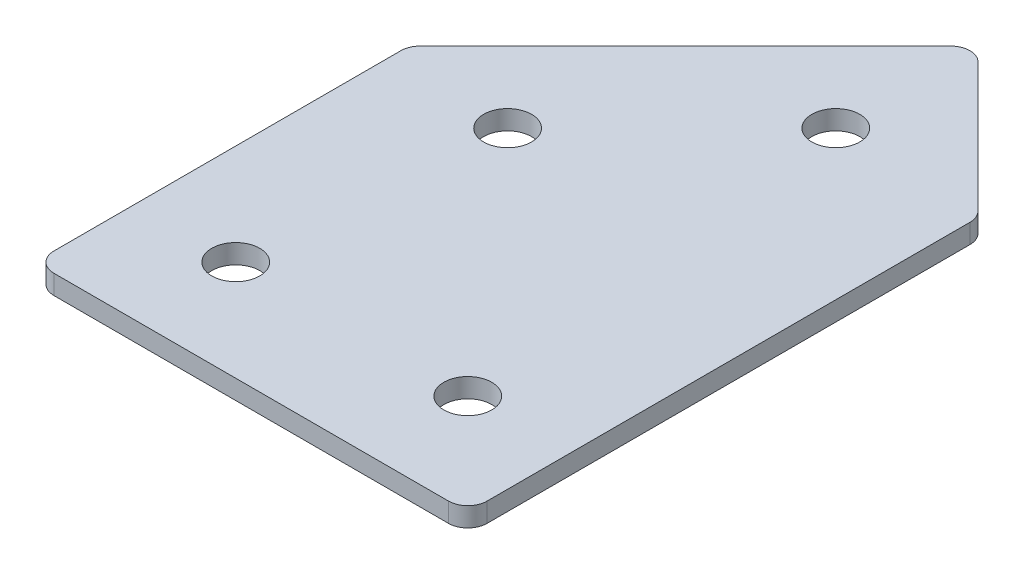
ISO-10303-21;
HEADER;
FILE_DESCRIPTION(('STEP AP214'),'2;1');
FILE_NAME('part.step','',(''),(''),'','','');
FILE_SCHEMA(('AUTOMOTIVE_DESIGN { 1 0 10303 214 1 1 1 1 }'));
ENDSEC;
DATA;
#1=APPLICATION_CONTEXT('core data for automotive mechanical design processes');
#2=APPLICATION_PROTOCOL_DEFINITION('international standard','automotive_design',2000,#1);
#3=PRODUCT_CONTEXT('',#1,'mechanical');
#4=PRODUCT('Part','Part','',(#3));
#5=PRODUCT_RELATED_PRODUCT_CATEGORY('part','',(#4));
#6=PRODUCT_DEFINITION_FORMATION('','',#4);
#7=PRODUCT_DEFINITION_CONTEXT('part definition',#1,'design');
#8=PRODUCT_DEFINITION('design','',#6,#7);
#9=PRODUCT_DEFINITION_SHAPE('','',#8);
#10=(LENGTH_UNIT() NAMED_UNIT(*) SI_UNIT(.MILLI.,.METRE.));
#11=(NAMED_UNIT(*) PLANE_ANGLE_UNIT() SI_UNIT($,.RADIAN.));
#12=(NAMED_UNIT(*) SI_UNIT($,.STERADIAN.) SOLID_ANGLE_UNIT());
#13=UNCERTAINTY_MEASURE_WITH_UNIT(LENGTH_MEASURE(1.E-05),#10,'distance_accuracy_value','');
#14=(GEOMETRIC_REPRESENTATION_CONTEXT(3) GLOBAL_UNCERTAINTY_ASSIGNED_CONTEXT((#13)) GLOBAL_UNIT_ASSIGNED_CONTEXT((#10,
#11,#12)) REPRESENTATION_CONTEXT('',''));
#15=CARTESIAN_POINT('',(0.,0.,0.));
#16=DIRECTION('',(0.,0.,1.));
#17=DIRECTION('',(1.,0.,0.));
#18=AXIS2_PLACEMENT_3D('',#15,#16,#17);
#19=CARTESIAN_POINT('',(-13.6552380952464,-1.25,26.3480194846605));
#20=DIRECTION('',(0.,1.,0.));
#21=DIRECTION('',(0.,0.,1.));
#22=AXIS2_PLACEMENT_3D('',#19,#20,#21);
#23=PLANE('',#22);
#24=CARTESIAN_POINT('',(46.3447619047619,-1.25,26.3480194846605));
#25=DIRECTION('',(0.,1.,0.));
#26=DIRECTION('',(0.,0.,1.));
#27=AXIS2_PLACEMENT_3D('',#24,#25,#26);
#28=CIRCLE('',#27,3.1);
#29=CARTESIAN_POINT('',(46.3447619047619,-1.25,29.4480194846605));
#30=VERTEX_POINT('',#29);
#31=EDGE_CURVE('E201',#30,#30,#28,.T.);
#32=ORIENTED_EDGE('',*,*,#31,.T.);
#33=EDGE_LOOP('',(#32));
#34=FACE_BOUND('',#33,.T.);
#35=CARTESIAN_POINT('',(40.1315584691654,-1.25,-27.438777079743));
#36=DIRECTION('',(0.,1.,0.));
#37=DIRECTION('',(0.,0.,1.));
#38=AXIS2_PLACEMENT_3D('',#35,#36,#37);
#39=CIRCLE('',#38,3.1);
#40=CARTESIAN_POINT('',(40.1315584691654,-1.25,-24.338777079743));
#41=VERTEX_POINT('',#40);
#42=EDGE_CURVE('E195',#41,#41,#39,.T.);
#43=ORIENTED_EDGE('',*,*,#42,.T.);
#44=EDGE_LOOP('',(#43));
#45=FACE_BOUND('',#44,.T.);
#46=CARTESIAN_POINT('',(18.918355033569,-1.25,-6.2255736441466));
#47=DIRECTION('',(0.,1.,0.));
#48=DIRECTION('',(0.,0.,1.));
#49=AXIS2_PLACEMENT_3D('',#46,#47,#48);
#50=CIRCLE('',#49,3.09999999999999);
#51=CARTESIAN_POINT('',(18.918355033569,-1.25,-3.12557364414661));
#52=VERTEX_POINT('',#51);
#53=EDGE_CURVE('E189',#52,#52,#50,.T.);
#54=ORIENTED_EDGE('',*,*,#53,.T.);
#55=EDGE_LOOP('',(#54));
#56=FACE_BOUND('',#55,.T.);
#57=CARTESIAN_POINT('',(16.3447619047619,-1.25,26.3480194846605));
#58=DIRECTION('',(0.,1.,0.));
#59=DIRECTION('',(0.,0.,1.));
#60=AXIS2_PLACEMENT_3D('',#57,#58,#59);
#61=CIRCLE('',#60,3.1);
#62=CARTESIAN_POINT('',(16.3447619047619,-1.25,29.4480194846605));
#63=VERTEX_POINT('',#62);
#64=EDGE_CURVE('E115',#63,#63,#61,.T.);
#65=ORIENTED_EDGE('',*,*,#64,.T.);
#66=EDGE_LOOP('',(#65));
#67=FACE_BOUND('',#66,.T.);
#68=DIRECTION('',(0.,0.,1.));
#69=VECTOR('',#68,1.);
#70=CARTESIAN_POINT('',(3.34476190476194,-1.25,-9.03675682619));
#71=LINE('',#70,#69);
#72=CARTESIAN_POINT('',(3.34476190476194,-1.25,-8.00122292025727));
#73=VERTEX_POINT('',#72);
#74=CARTESIAN_POINT('',(3.34476190476194,-1.25,36.8480194846606));
#75=VERTEX_POINT('',#74);
#76=EDGE_CURVE('E182',#73,#75,#71,.T.);
#77=ORIENTED_EDGE('',*,*,#76,.F.);
#78=CARTESIAN_POINT('',(5.84476190476194,-1.25,-8.00122292025727));
#79=DIRECTION('',(0.,1.,0.));
#80=DIRECTION('',(0.,0.,1.));
#81=AXIS2_PLACEMENT_3D('',#78,#79,#80);
#82=CIRCLE('',#81,2.5);
#83=CARTESIAN_POINT('',(4.07699495179559,-1.25,-9.76898987322365));
#84=VERTEX_POINT('',#83);
#85=EDGE_CURVE('E146',#73,#84,#82,.F.);
#86=ORIENTED_EDGE('',*,*,#85,.T.);
#87=DIRECTION('',(-0.707106781186547,0.,0.707106781186548));
#88=VECTOR('',#87,1.);
#89=CARTESIAN_POINT('',(40.1315584691653,-1.25,-45.8235533905934));
#90=LINE('',#89,#88);
#91=CARTESIAN_POINT('',(38.3637915161989,-1.25,-44.055786437627));
#92=VERTEX_POINT('',#91);
#93=EDGE_CURVE('E174',#92,#84,#90,.T.);
#94=ORIENTED_EDGE('',*,*,#93,.F.);
#95=CARTESIAN_POINT('',(40.1315584691653,-1.25,-42.2880194846606));
#96=DIRECTION('',(0.,1.,0.));
#97=DIRECTION('',(0.,0.,1.));
#98=AXIS2_PLACEMENT_3D('',#95,#96,#97);
#99=CIRCLE('',#98,2.5);
#100=CARTESIAN_POINT('',(41.8993254221316,-1.25,-44.055786437627));
#101=VERTEX_POINT('',#100);
#102=EDGE_CURVE('E118',#92,#101,#99,.F.);
#103=ORIENTED_EDGE('',*,*,#102,.T.);
#104=DIRECTION('',(-0.707106781186547,0.,-0.707106781186548));
#105=VECTOR('',#104,1.);
#106=CARTESIAN_POINT('',(59.3447619047619,-1.25,-26.6103499549967));
#107=LINE('',#106,#105);
#108=CARTESIAN_POINT('',(58.6125288577283,-1.25,-27.3425830020304));
#109=VERTEX_POINT('',#108);
#110=EDGE_CURVE('E119',#109,#101,#107,.T.);
#111=ORIENTED_EDGE('',*,*,#110,.F.);
#112=CARTESIAN_POINT('',(56.8447619047619,-1.25,-25.574816049064));
#113=DIRECTION('',(0.,1.,0.));
#114=DIRECTION('',(0.,0.,1.));
#115=AXIS2_PLACEMENT_3D('',#112,#113,#114);
#116=CIRCLE('',#115,2.5);
#117=CARTESIAN_POINT('',(59.3447619047619,-1.25,-25.574816049064));
#118=VERTEX_POINT('',#117);
#119=EDGE_CURVE('E141',#109,#118,#116,.F.);
#120=ORIENTED_EDGE('',*,*,#119,.T.);
#121=DIRECTION('',(0.,0.,-1.));
#122=VECTOR('',#121,1.);
#123=CARTESIAN_POINT('',(59.3447619047619,-1.25,39.3480194846606));
#124=LINE('',#123,#122);
#125=CARTESIAN_POINT('',(59.3447619047619,-1.25,36.8480194846606));
#126=VERTEX_POINT('',#125);
#127=EDGE_CURVE('E123',#126,#118,#124,.T.);
#128=ORIENTED_EDGE('',*,*,#127,.F.);
#129=CARTESIAN_POINT('',(56.8447619047619,-1.25,36.8480194846606));
#130=DIRECTION('',(0.,1.,0.));
#131=DIRECTION('',(0.,0.,1.));
#132=AXIS2_PLACEMENT_3D('',#129,#130,#131);
#133=CIRCLE('',#132,2.5);
#134=CARTESIAN_POINT('',(56.8447619047619,-1.25,39.3480194846606));
#135=VERTEX_POINT('',#134);
#136=EDGE_CURVE('E31',#126,#135,#133,.F.);
#137=ORIENTED_EDGE('',*,*,#136,.T.);
#138=DIRECTION('',(1.,0.,0.));
#139=VECTOR('',#138,1.);
#140=CARTESIAN_POINT('',(3.34476190476194,-1.25,39.3480194846606));
#141=LINE('',#140,#139);
#142=CARTESIAN_POINT('',(5.84476190476194,-1.25,39.3480194846606));
#143=VERTEX_POINT('',#142);
#144=EDGE_CURVE('E180',#143,#135,#141,.T.);
#145=ORIENTED_EDGE('',*,*,#144,.F.);
#146=CARTESIAN_POINT('',(5.84476190476194,-1.25,36.8480194846606));
#147=DIRECTION('',(0.,1.,0.));
#148=DIRECTION('',(0.,0.,1.));
#149=AXIS2_PLACEMENT_3D('',#146,#147,#148);
#150=CIRCLE('',#149,2.5);
#151=EDGE_CURVE('E144',#143,#75,#150,.F.);
#152=ORIENTED_EDGE('',*,*,#151,.T.);
#153=EDGE_LOOP('',(#77,#86,#94,#103,#111,#120,#128,#137,#145,#152));
#154=FACE_BOUND('',#153,.T.);
#155=ADVANCED_FACE('F16',(#34,#45,#56,#67,#154),#23,.F.);
#156=CARTESIAN_POINT('',(40.1315584691653,-1.25,-45.8235533905934));
#157=DIRECTION('',(-0.707106781186548,0.,-0.707106781186547));
#158=DIRECTION('',(-0.707106781186547,0.,0.707106781186548));
#159=AXIS2_PLACEMENT_3D('',#156,#157,#158);
#160=PLANE('',#159);
#161=ORIENTED_EDGE('',*,*,#93,.T.);
#162=DIRECTION('',(0.,1.,0.));
#163=VECTOR('',#162,1.);
#164=CARTESIAN_POINT('',(4.07699495179558,-1.25,-9.76898987322364));
#165=LINE('',#164,#163);
#166=CARTESIAN_POINT('',(4.07699495179559,1.25,-9.76898987322365));
#167=VERTEX_POINT('',#166);
#168=EDGE_CURVE('E105',#84,#167,#165,.T.);
#169=ORIENTED_EDGE('',*,*,#168,.T.);
#170=DIRECTION('',(-0.707106781186547,0.,0.707106781186548));
#171=VECTOR('',#170,1.);
#172=CARTESIAN_POINT('',(40.1315584691653,1.25,-45.8235533905934));
#173=LINE('',#172,#171);
#174=CARTESIAN_POINT('',(38.3637915161989,1.25,-44.055786437627));
#175=VERTEX_POINT('',#174);
#176=EDGE_CURVE('E97',#175,#167,#173,.T.);
#177=ORIENTED_EDGE('',*,*,#176,.F.);
#178=DIRECTION('',(0.,1.,0.));
#179=VECTOR('',#178,1.);
#180=CARTESIAN_POINT('',(38.3637915161989,-1.25,-44.055786437627));
#181=LINE('',#180,#179);
#182=EDGE_CURVE('E111',#175,#92,#181,.F.);
#183=ORIENTED_EDGE('',*,*,#182,.T.);
#184=EDGE_LOOP('',(#161,#169,#177,#183));
#185=FACE_BOUND('',#184,.T.);
#186=ADVANCED_FACE('F110',(#185),#160,.T.);
#187=CARTESIAN_POINT('',(59.3447619047619,-1.25,-26.6103499549967));
#188=DIRECTION('',(0.707106781186548,0.,-0.707106781186547));
#189=DIRECTION('',(-0.707106781186547,0.,-0.707106781186548));
#190=AXIS2_PLACEMENT_3D('',#187,#188,#189);
#191=PLANE('',#190);
#192=DIRECTION('',(-0.707106781186547,0.,-0.707106781186548));
#193=VECTOR('',#192,1.);
#194=CARTESIAN_POINT('',(59.3447619047619,1.25,-26.6103499549967));
#195=LINE('',#194,#193);
#196=CARTESIAN_POINT('',(58.6125288577283,1.25,-27.3425830020304));
#197=VERTEX_POINT('',#196);
#198=CARTESIAN_POINT('',(41.8993254221316,1.25,-44.055786437627));
#199=VERTEX_POINT('',#198);
#200=EDGE_CURVE('E99',#197,#199,#195,.T.);
#201=ORIENTED_EDGE('',*,*,#200,.F.);
#202=DIRECTION('',(0.,1.,0.));
#203=VECTOR('',#202,1.);
#204=CARTESIAN_POINT('',(58.6125288577283,-1.25,-27.3425830020304));
#205=LINE('',#204,#203);
#206=EDGE_CURVE('E10',#197,#109,#205,.F.);
#207=ORIENTED_EDGE('',*,*,#206,.T.);
#208=ORIENTED_EDGE('',*,*,#110,.T.);
#209=DIRECTION('',(0.,1.,0.));
#210=VECTOR('',#209,1.);
#211=CARTESIAN_POINT('',(41.8993254221316,-1.25,-44.055786437627));
#212=LINE('',#211,#210);
#213=EDGE_CURVE('E24',#101,#199,#212,.T.);
#214=ORIENTED_EDGE('',*,*,#213,.T.);
#215=EDGE_LOOP('',(#201,#207,#208,#214));
#216=FACE_BOUND('',#215,.T.);
#217=ADVANCED_FACE('F157',(#216),#191,.T.);
#218=CARTESIAN_POINT('',(59.3447619047619,-1.25,39.3480194846606));
#219=DIRECTION('',(1.,0.,0.));
#220=DIRECTION('',(0.,0.,-1.));
#221=AXIS2_PLACEMENT_3D('',#218,#219,#220);
#222=PLANE('',#221);
#223=DIRECTION('',(0.,0.,-1.));
#224=VECTOR('',#223,1.);
#225=CARTESIAN_POINT('',(59.3447619047619,1.25,39.3480194846606));
#226=LINE('',#225,#224);
#227=CARTESIAN_POINT('',(59.3447619047619,1.25,36.8480194846606));
#228=VERTEX_POINT('',#227);
#229=CARTESIAN_POINT('',(59.3447619047619,1.25,-25.574816049064));
#230=VERTEX_POINT('',#229);
#231=EDGE_CURVE('E170',#228,#230,#226,.T.);
#232=ORIENTED_EDGE('',*,*,#231,.F.);
#233=DIRECTION('',(0.,1.,0.));
#234=VECTOR('',#233,1.);
#235=CARTESIAN_POINT('',(59.3447619047619,-1.25,36.8480194846606));
#236=LINE('',#235,#234);
#237=EDGE_CURVE('E155',#228,#126,#236,.F.);
#238=ORIENTED_EDGE('',*,*,#237,.T.);
#239=ORIENTED_EDGE('',*,*,#127,.T.);
#240=DIRECTION('',(0.,1.,0.));
#241=VECTOR('',#240,1.);
#242=CARTESIAN_POINT('',(59.3447619047619,-1.25,-25.574816049064));
#243=LINE('',#242,#241);
#244=EDGE_CURVE('E152',#118,#230,#243,.T.);
#245=ORIENTED_EDGE('',*,*,#244,.T.);
#246=EDGE_LOOP('',(#232,#238,#239,#245));
#247=FACE_BOUND('',#246,.T.);
#248=ADVANCED_FACE('F169',(#247),#222,.T.);
#249=CARTESIAN_POINT('',(3.34476190476194,-1.25,39.3480194846606));
#250=DIRECTION('',(0.,0.,1.));
#251=DIRECTION('',(1.,0.,0.));
#252=AXIS2_PLACEMENT_3D('',#249,#250,#251);
#253=PLANE('',#252);
#254=DIRECTION('',(1.,0.,0.));
#255=VECTOR('',#254,1.);
#256=CARTESIAN_POINT('',(3.34476190476194,1.25,39.3480194846606));
#257=LINE('',#256,#255);
#258=CARTESIAN_POINT('',(5.84476190476194,1.25,39.3480194846606));
#259=VERTEX_POINT('',#258);
#260=CARTESIAN_POINT('',(56.8447619047619,1.25,39.3480194846606));
#261=VERTEX_POINT('',#260);
#262=EDGE_CURVE('E173',#259,#261,#257,.T.);
#263=ORIENTED_EDGE('',*,*,#262,.F.);
#264=DIRECTION('',(0.,1.,0.));
#265=VECTOR('',#264,1.);
#266=CARTESIAN_POINT('',(5.84476190476194,-1.25,39.3480194846606));
#267=LINE('',#266,#265);
#268=EDGE_CURVE('E38',#259,#143,#267,.F.);
#269=ORIENTED_EDGE('',*,*,#268,.T.);
#270=ORIENTED_EDGE('',*,*,#144,.T.);
#271=DIRECTION('',(0.,1.,0.));
#272=VECTOR('',#271,1.);
#273=CARTESIAN_POINT('',(56.8447619047619,-1.25,39.3480194846606));
#274=LINE('',#273,#272);
#275=EDGE_CURVE('E148',#135,#261,#274,.T.);
#276=ORIENTED_EDGE('',*,*,#275,.T.);
#277=EDGE_LOOP('',(#263,#269,#270,#276));
#278=FACE_BOUND('',#277,.T.);
#279=ADVANCED_FACE('F333',(#278),#253,.T.);
#280=CARTESIAN_POINT('',(3.34476190476194,-1.25,-9.03675682619));
#281=DIRECTION('',(-1.,0.,0.));
#282=DIRECTION('',(0.,0.,1.));
#283=AXIS2_PLACEMENT_3D('',#280,#281,#282);
#284=PLANE('',#283);
#285=DIRECTION('',(0.,0.,1.));
#286=VECTOR('',#285,1.);
#287=CARTESIAN_POINT('',(3.34476190476194,1.25,-9.03675682619));
#288=LINE('',#287,#286);
#289=CARTESIAN_POINT('',(3.34476190476194,1.25,-8.00122292025727));
#290=VERTEX_POINT('',#289);
#291=CARTESIAN_POINT('',(3.34476190476194,1.25,36.8480194846606));
#292=VERTEX_POINT('',#291);
#293=EDGE_CURVE('E114',#290,#292,#288,.T.);
#294=ORIENTED_EDGE('',*,*,#293,.F.);
#295=DIRECTION('',(0.,1.,0.));
#296=VECTOR('',#295,1.);
#297=CARTESIAN_POINT('',(3.34476190476194,-1.25,-8.00122292025727));
#298=LINE('',#297,#296);
#299=EDGE_CURVE('E138',#290,#73,#298,.F.);
#300=ORIENTED_EDGE('',*,*,#299,.T.);
#301=ORIENTED_EDGE('',*,*,#76,.T.);
#302=DIRECTION('',(0.,1.,0.));
#303=VECTOR('',#302,1.);
#304=CARTESIAN_POINT('',(3.34476190476194,-1.25,36.8480194846606));
#305=LINE('',#304,#303);
#306=EDGE_CURVE('E135',#75,#292,#305,.T.);
#307=ORIENTED_EDGE('',*,*,#306,.T.);
#308=EDGE_LOOP('',(#294,#300,#301,#307));
#309=FACE_BOUND('',#308,.T.);
#310=ADVANCED_FACE('F223',(#309),#284,.T.);
#311=CARTESIAN_POINT('',(-13.6552380952464,1.25,26.3480194846605));
#312=DIRECTION('',(0.,1.,0.));
#313=DIRECTION('',(0.,0.,1.));
#314=AXIS2_PLACEMENT_3D('',#311,#312,#313);
#315=PLANE('',#314);
#316=CARTESIAN_POINT('',(46.3447619047619,1.25,26.3480194846605));
#317=DIRECTION('',(0.,1.,0.));
#318=DIRECTION('',(0.,0.,1.));
#319=AXIS2_PLACEMENT_3D('',#316,#317,#318);
#320=CIRCLE('',#319,3.1);
#321=CARTESIAN_POINT('',(46.3447619047619,1.25,29.4480194846605));
#322=VERTEX_POINT('',#321);
#323=EDGE_CURVE('E204',#322,#322,#320,.T.);
#324=ORIENTED_EDGE('',*,*,#323,.F.);
#325=EDGE_LOOP('',(#324));
#326=FACE_BOUND('',#325,.T.);
#327=CARTESIAN_POINT('',(40.1315584691654,1.25,-27.438777079743));
#328=DIRECTION('',(0.,1.,0.));
#329=DIRECTION('',(0.,0.,1.));
#330=AXIS2_PLACEMENT_3D('',#327,#328,#329);
#331=CIRCLE('',#330,3.1);
#332=CARTESIAN_POINT('',(40.1315584691654,1.25,-24.338777079743));
#333=VERTEX_POINT('',#332);
#334=EDGE_CURVE('E198',#333,#333,#331,.T.);
#335=ORIENTED_EDGE('',*,*,#334,.F.);
#336=EDGE_LOOP('',(#335));
#337=FACE_BOUND('',#336,.T.);
#338=CARTESIAN_POINT('',(18.918355033569,1.25,-6.2255736441466));
#339=DIRECTION('',(0.,1.,0.));
#340=DIRECTION('',(0.,0.,1.));
#341=AXIS2_PLACEMENT_3D('',#338,#339,#340);
#342=CIRCLE('',#341,3.09999999999999);
#343=CARTESIAN_POINT('',(18.918355033569,1.25,-3.12557364414661));
#344=VERTEX_POINT('',#343);
#345=EDGE_CURVE('E192',#344,#344,#342,.T.);
#346=ORIENTED_EDGE('',*,*,#345,.F.);
#347=EDGE_LOOP('',(#346));
#348=FACE_BOUND('',#347,.T.);
#349=CARTESIAN_POINT('',(16.3447619047619,1.25,26.3480194846605));
#350=DIRECTION('',(0.,1.,0.));
#351=DIRECTION('',(0.,0.,1.));
#352=AXIS2_PLACEMENT_3D('',#349,#350,#351);
#353=CIRCLE('',#352,3.1);
#354=CARTESIAN_POINT('',(16.3447619047619,1.25,29.4480194846605));
#355=VERTEX_POINT('',#354);
#356=EDGE_CURVE('E186',#355,#355,#353,.T.);
#357=ORIENTED_EDGE('',*,*,#356,.F.);
#358=EDGE_LOOP('',(#357));
#359=FACE_BOUND('',#358,.T.);
#360=ORIENTED_EDGE('',*,*,#176,.T.);
#361=CARTESIAN_POINT('',(5.84476190476194,1.25,-8.00122292025727));
#362=DIRECTION('',(0.,1.,0.));
#363=DIRECTION('',(0.,0.,1.));
#364=AXIS2_PLACEMENT_3D('',#361,#362,#363);
#365=CIRCLE('',#364,2.5);
#366=EDGE_CURVE('E133',#167,#290,#365,.T.);
#367=ORIENTED_EDGE('',*,*,#366,.T.);
#368=ORIENTED_EDGE('',*,*,#293,.T.);
#369=CARTESIAN_POINT('',(5.84476190476194,1.25,36.8480194846606));
#370=DIRECTION('',(0.,1.,0.));
#371=DIRECTION('',(0.,0.,1.));
#372=AXIS2_PLACEMENT_3D('',#369,#370,#371);
#373=CIRCLE('',#372,2.5);
#374=EDGE_CURVE('E131',#292,#259,#373,.T.);
#375=ORIENTED_EDGE('',*,*,#374,.T.);
#376=ORIENTED_EDGE('',*,*,#262,.T.);
#377=CARTESIAN_POINT('',(56.8447619047619,1.25,36.8480194846606));
#378=DIRECTION('',(0.,1.,0.));
#379=DIRECTION('',(0.,0.,1.));
#380=AXIS2_PLACEMENT_3D('',#377,#378,#379);
#381=CIRCLE('',#380,2.5);
#382=EDGE_CURVE('E129',#261,#228,#381,.T.);
#383=ORIENTED_EDGE('',*,*,#382,.T.);
#384=ORIENTED_EDGE('',*,*,#231,.T.);
#385=CARTESIAN_POINT('',(56.8447619047619,1.25,-25.574816049064));
#386=DIRECTION('',(0.,1.,0.));
#387=DIRECTION('',(0.,0.,1.));
#388=AXIS2_PLACEMENT_3D('',#385,#386,#387);
#389=CIRCLE('',#388,2.5);
#390=EDGE_CURVE('E104',#230,#197,#389,.T.);
#391=ORIENTED_EDGE('',*,*,#390,.T.);
#392=ORIENTED_EDGE('',*,*,#200,.T.);
#393=CARTESIAN_POINT('',(40.1315584691653,1.25,-42.2880194846606));
#394=DIRECTION('',(0.,1.,0.));
#395=DIRECTION('',(0.,0.,1.));
#396=AXIS2_PLACEMENT_3D('',#393,#394,#395);
#397=CIRCLE('',#396,2.5);
#398=EDGE_CURVE('E94',#199,#175,#397,.T.);
#399=ORIENTED_EDGE('',*,*,#398,.T.);
#400=EDGE_LOOP('',(#360,#367,#368,#375,#376,#383,#384,#391,#392,#399));
#401=FACE_BOUND('',#400,.T.);
#402=ADVANCED_FACE('F96',(#326,#337,#348,#359,#401),#315,.T.);
#403=CARTESIAN_POINT('',(16.3447619047619,-1.25,26.3480194846605));
#404=DIRECTION('',(0.,1.,0.));
#405=DIRECTION('',(0.,0.,1.));
#406=AXIS2_PLACEMENT_3D('',#403,#404,#405);
#407=CYLINDRICAL_SURFACE('',#406,3.1);
#408=ORIENTED_EDGE('',*,*,#64,.F.);
#409=EDGE_LOOP('',(#408));
#410=FACE_BOUND('',#409,.T.);
#411=ORIENTED_EDGE('',*,*,#356,.T.);
#412=EDGE_LOOP('',(#411));
#413=FACE_BOUND('',#412,.T.);
#414=ADVANCED_FACE('F222',(#410,#413),#407,.F.);
#415=CARTESIAN_POINT('',(18.918355033569,-1.25,-6.2255736441466));
#416=DIRECTION('',(0.,1.,0.));
#417=DIRECTION('',(0.,0.,1.));
#418=AXIS2_PLACEMENT_3D('',#415,#416,#417);
#419=CYLINDRICAL_SURFACE('',#418,3.09999999999999);
#420=ORIENTED_EDGE('',*,*,#53,.F.);
#421=EDGE_LOOP('',(#420));
#422=FACE_BOUND('',#421,.T.);
#423=ORIENTED_EDGE('',*,*,#345,.T.);
#424=EDGE_LOOP('',(#423));
#425=FACE_BOUND('',#424,.T.);
#426=ADVANCED_FACE('F232',(#422,#425),#419,.F.);
#427=CARTESIAN_POINT('',(40.1315584691654,-1.25,-27.438777079743));
#428=DIRECTION('',(0.,1.,0.));
#429=DIRECTION('',(0.,0.,1.));
#430=AXIS2_PLACEMENT_3D('',#427,#428,#429);
#431=CYLINDRICAL_SURFACE('',#430,3.1);
#432=ORIENTED_EDGE('',*,*,#42,.F.);
#433=EDGE_LOOP('',(#432));
#434=FACE_BOUND('',#433,.T.);
#435=ORIENTED_EDGE('',*,*,#334,.T.);
#436=EDGE_LOOP('',(#435));
#437=FACE_BOUND('',#436,.T.);
#438=ADVANCED_FACE('F216',(#434,#437),#431,.F.);
#439=CARTESIAN_POINT('',(46.3447619047619,-1.25,26.3480194846605));
#440=DIRECTION('',(0.,1.,0.));
#441=DIRECTION('',(0.,0.,1.));
#442=AXIS2_PLACEMENT_3D('',#439,#440,#441);
#443=CYLINDRICAL_SURFACE('',#442,3.1);
#444=ORIENTED_EDGE('',*,*,#31,.F.);
#445=EDGE_LOOP('',(#444));
#446=FACE_BOUND('',#445,.T.);
#447=ORIENTED_EDGE('',*,*,#323,.T.);
#448=EDGE_LOOP('',(#447));
#449=FACE_BOUND('',#448,.T.);
#450=ADVANCED_FACE('F212',(#446,#449),#443,.F.);
#451=CARTESIAN_POINT('',(5.84476190476194,-1.25,-8.00122292025727));
#452=DIRECTION('',(0.,1.,0.));
#453=DIRECTION('',(0.,0.,1.));
#454=AXIS2_PLACEMENT_3D('',#451,#452,#453);
#455=CYLINDRICAL_SURFACE('',#454,2.5);
#456=ORIENTED_EDGE('',*,*,#85,.F.);
#457=ORIENTED_EDGE('',*,*,#299,.F.);
#458=ORIENTED_EDGE('',*,*,#366,.F.);
#459=ORIENTED_EDGE('',*,*,#168,.F.);
#460=EDGE_LOOP('',(#456,#457,#458,#459));
#461=FACE_BOUND('',#460,.T.);
#462=ADVANCED_FACE('F215',(#461),#455,.T.);
#463=CARTESIAN_POINT('',(5.84476190476194,-1.25,36.8480194846606));
#464=DIRECTION('',(0.,1.,0.));
#465=DIRECTION('',(0.,0.,1.));
#466=AXIS2_PLACEMENT_3D('',#463,#464,#465);
#467=CYLINDRICAL_SURFACE('',#466,2.5);
#468=ORIENTED_EDGE('',*,*,#151,.F.);
#469=ORIENTED_EDGE('',*,*,#268,.F.);
#470=ORIENTED_EDGE('',*,*,#374,.F.);
#471=ORIENTED_EDGE('',*,*,#306,.F.);
#472=EDGE_LOOP('',(#468,#469,#470,#471));
#473=FACE_BOUND('',#472,.T.);
#474=ADVANCED_FACE('F252',(#473),#467,.T.);
#475=CARTESIAN_POINT('',(56.8447619047619,-1.25,36.8480194846606));
#476=DIRECTION('',(0.,1.,0.));
#477=DIRECTION('',(0.,0.,1.));
#478=AXIS2_PLACEMENT_3D('',#475,#476,#477);
#479=CYLINDRICAL_SURFACE('',#478,2.5);
#480=ORIENTED_EDGE('',*,*,#136,.F.);
#481=ORIENTED_EDGE('',*,*,#237,.F.);
#482=ORIENTED_EDGE('',*,*,#382,.F.);
#483=ORIENTED_EDGE('',*,*,#275,.F.);
#484=EDGE_LOOP('',(#480,#481,#482,#483));
#485=FACE_BOUND('',#484,.T.);
#486=ADVANCED_FACE('F256',(#485),#479,.T.);
#487=CARTESIAN_POINT('',(56.8447619047619,-1.25,-25.574816049064));
#488=DIRECTION('',(0.,1.,0.));
#489=DIRECTION('',(0.,0.,1.));
#490=AXIS2_PLACEMENT_3D('',#487,#488,#489);
#491=CYLINDRICAL_SURFACE('',#490,2.5);
#492=ORIENTED_EDGE('',*,*,#119,.F.);
#493=ORIENTED_EDGE('',*,*,#206,.F.);
#494=ORIENTED_EDGE('',*,*,#390,.F.);
#495=ORIENTED_EDGE('',*,*,#244,.F.);
#496=EDGE_LOOP('',(#492,#493,#494,#495));
#497=FACE_BOUND('',#496,.T.);
#498=ADVANCED_FACE('F165',(#497),#491,.T.);
#499=CARTESIAN_POINT('',(40.1315584691653,-1.25,-42.2880194846606));
#500=DIRECTION('',(0.,1.,0.));
#501=DIRECTION('',(0.,0.,1.));
#502=AXIS2_PLACEMENT_3D('',#499,#500,#501);
#503=CYLINDRICAL_SURFACE('',#502,2.5);
#504=ORIENTED_EDGE('',*,*,#102,.F.);
#505=ORIENTED_EDGE('',*,*,#182,.F.);
#506=ORIENTED_EDGE('',*,*,#398,.F.);
#507=ORIENTED_EDGE('',*,*,#213,.F.);
#508=EDGE_LOOP('',(#504,#505,#506,#507));
#509=FACE_BOUND('',#508,.T.);
#510=ADVANCED_FACE('F18',(#509),#503,.T.);
#511=CLOSED_SHELL('',(#155,#186,#217,#248,#279,#310,#402,#414,#426,#438,#450,#462,#474,#486,
#498,#510));
#512=MANIFOLD_SOLID_BREP('B1',#511);
#513=ADVANCED_BREP_SHAPE_REPRESENTATION('',(#18,#512),#14);
#514=SHAPE_DEFINITION_REPRESENTATION(#9,#513);
ENDSEC;
END-ISO-10303-21;
